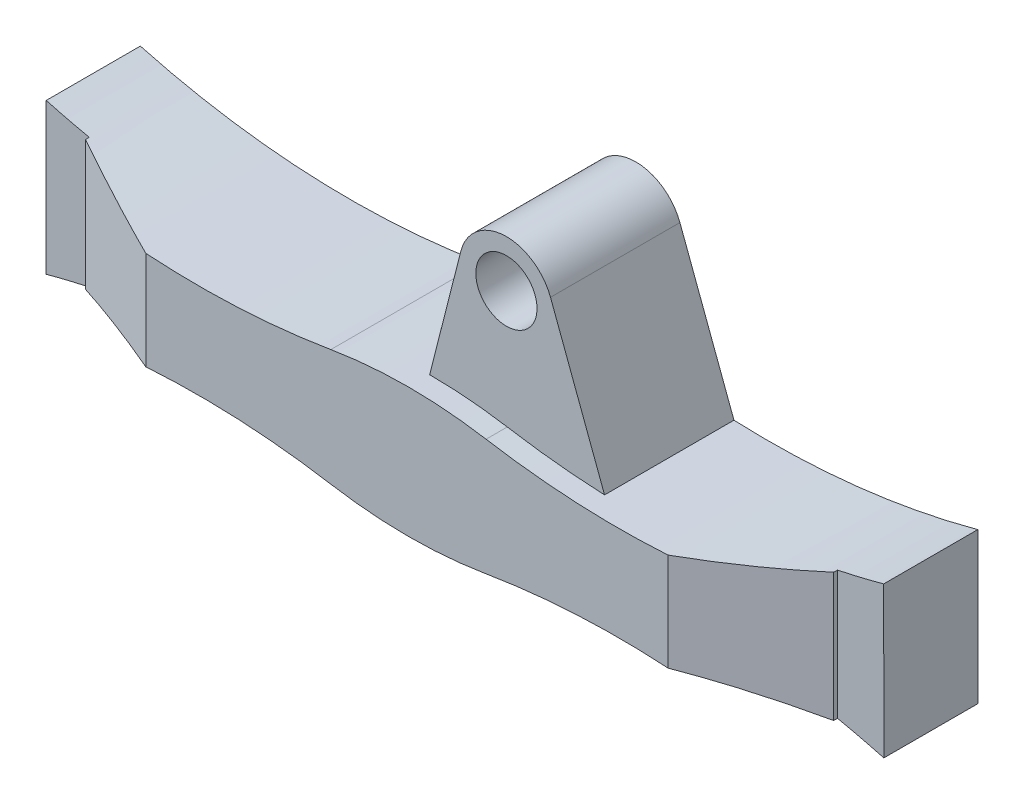
ISO-10303-21;
HEADER;
FILE_DESCRIPTION(('STEP AP214'),'2;1');
FILE_NAME('part.step','',(''),(''),'','','');
FILE_SCHEMA(('AUTOMOTIVE_DESIGN { 1 0 10303 214 1 1 1 1 }'));
ENDSEC;
DATA;
#1=APPLICATION_CONTEXT('core data for automotive mechanical design processes');
#2=APPLICATION_PROTOCOL_DEFINITION('international standard','automotive_design',2000,#1);
#3=PRODUCT_CONTEXT('',#1,'mechanical');
#4=PRODUCT('Part','Part','',(#3));
#5=PRODUCT_RELATED_PRODUCT_CATEGORY('part','',(#4));
#6=PRODUCT_DEFINITION_FORMATION('','',#4);
#7=PRODUCT_DEFINITION_CONTEXT('part definition',#1,'design');
#8=PRODUCT_DEFINITION('design','',#6,#7);
#9=PRODUCT_DEFINITION_SHAPE('','',#8);
#10=(LENGTH_UNIT() NAMED_UNIT(*) SI_UNIT(.MILLI.,.METRE.));
#11=(NAMED_UNIT(*) PLANE_ANGLE_UNIT() SI_UNIT($,.RADIAN.));
#12=(NAMED_UNIT(*) SI_UNIT($,.STERADIAN.) SOLID_ANGLE_UNIT());
#13=UNCERTAINTY_MEASURE_WITH_UNIT(LENGTH_MEASURE(1.E-05),#10,'distance_accuracy_value','');
#14=(GEOMETRIC_REPRESENTATION_CONTEXT(3) GLOBAL_UNCERTAINTY_ASSIGNED_CONTEXT((#13)) GLOBAL_UNIT_ASSIGNED_CONTEXT((#10,
#11,#12)) REPRESENTATION_CONTEXT('',''));
#15=CARTESIAN_POINT('',(0.,0.,0.));
#16=DIRECTION('',(0.,0.,1.));
#17=DIRECTION('',(1.,0.,0.));
#18=AXIS2_PLACEMENT_3D('',#15,#16,#17);
#19=CARTESIAN_POINT('',(6.27431846807554,14.0509458142658,14.0514516902904));
#20=DIRECTION('',(0.,0.,1.));
#21=DIRECTION('',(1.,0.,0.));
#22=AXIS2_PLACEMENT_3D('',#19,#20,#21);
#23=PLANE('',#22);
#24=CARTESIAN_POINT('',(7.93862948280425,17.7847876623105,14.0514516902904));
#25=DIRECTION('',(0.,0.,-1.));
#26=DIRECTION('',(-1.,0.,0.));
#27=AXIS2_PLACEMENT_3D('',#24,#25,#26);
#28=CIRCLE('',#27,0.65);
#29=CARTESIAN_POINT('',(7.28862948280424,17.7847876623105,14.0514516902904));
#30=VERTEX_POINT('',#29);
#31=EDGE_CURVE('E338',#30,#30,#28,.T.);
#32=ORIENTED_EDGE('',*,*,#31,.F.);
#33=EDGE_LOOP('',(#32));
#34=FACE_BOUND('',#33,.T.);
#35=DIRECTION('',(-0.00145502542858702,-0.999998941449941,0.));
#36=VECTOR('',#35,1.);
#37=CARTESIAN_POINT('',(-2.59314168113384,14.0638482079277,14.0514516902904));
#38=LINE('',#37,#36);
#39=CARTESIAN_POINT('',(-2.5908324113145,15.6509458142658,14.0514516902904));
#40=VERTEX_POINT('',#39);
#41=CARTESIAN_POINT('',(-2.59548849761467,12.4509458142658,14.0514516902904));
#42=VERTEX_POINT('',#41);
#43=EDGE_CURVE('E179',#40,#42,#38,.T.);
#44=ORIENTED_EDGE('',*,*,#43,.F.);
#45=CARTESIAN_POINT('',(1.85800012354398,32.0299671285904,14.0514516902904));
#46=DIRECTION('',(0.,0.,-1.));
#47=DIRECTION('',(-1.,0.,0.));
#48=AXIS2_PLACEMENT_3D('',#45,#46,#47);
#49=CIRCLE('',#48,16.9724615226641);
#50=CARTESIAN_POINT('',(4.65743461176132,15.2899666302483,14.0514516902904));
#51=VERTEX_POINT('',#50);
#52=EDGE_CURVE('E192',#40,#51,#49,.F.);
#53=ORIENTED_EDGE('',*,*,#52,.T.);
#54=CARTESIAN_POINT('',(6.30683265840241,5.42693027810318,14.0514516902904));
#55=DIRECTION('',(0.,0.,1.));
#56=DIRECTION('',(1.,0.,0.));
#57=AXIS2_PLACEMENT_3D('',#54,#55,#56);
#58=CIRCLE('',#57,10.);
#59=CARTESIAN_POINT('',(6.30683265840242,15.4269302781032,14.0514516902904));
#60=VERTEX_POINT('',#59);
#61=EDGE_CURVE('E292',#51,#60,#58,.F.);
#62=ORIENTED_EDGE('',*,*,#61,.T.);
#63=DIRECTION('',(0.246583767028973,0.969121481465457,0.));
#64=VECTOR('',#63,1.);
#65=CARTESIAN_POINT('',(2.23678706441933,-0.569129248432469,14.0514516902904));
#66=LINE('',#65,#64);
#67=CARTESIAN_POINT('',(6.96950800133879,18.0313714293395,14.0514516902904));
#68=VERTEX_POINT('',#67);
#69=EDGE_CURVE('E335',#60,#68,#66,.T.);
#70=ORIENTED_EDGE('',*,*,#69,.T.);
#71=CARTESIAN_POINT('',(7.93862948280425,17.7847876623105,14.0514516902904));
#72=DIRECTION('',(0.,0.,-1.));
#73=DIRECTION('',(-1.,0.,0.));
#74=AXIS2_PLACEMENT_3D('',#71,#72,#73);
#75=CIRCLE('',#74,0.999999999999999);
#76=CARTESIAN_POINT('',(8.87494823103114,18.1359389142217,14.0514516902904));
#77=VERTEX_POINT('',#76);
#78=EDGE_CURVE('E332',#68,#77,#75,.T.);
#79=ORIENTED_EDGE('',*,*,#78,.T.);
#80=DIRECTION('',(-0.351151251911223,0.936318748226896,0.));
#81=VECTOR('',#80,1.);
#82=CARTESIAN_POINT('',(13.743509498287,5.15428167503463,14.0514516902904));
#83=LINE('',#82,#81);
#84=CARTESIAN_POINT('',(10.0235402901545,15.0733034454077,14.0514516902904));
#85=VERTEX_POINT('',#84);
#86=EDGE_CURVE('E328',#85,#77,#83,.T.);
#87=ORIENTED_EDGE('',*,*,#86,.F.);
#88=CARTESIAN_POINT('',(10.7556651932609,32.0299671285904,14.0514516902904));
#89=DIRECTION('',(0.,0.,-1.));
#90=DIRECTION('',(-1.,0.,0.));
#91=AXIS2_PLACEMENT_3D('',#88,#89,#90);
#92=CIRCLE('',#91,16.9724615226641);
#93=CARTESIAN_POINT('',(15.2044977281194,15.6509458142658,14.0514516902904));
#94=VERTEX_POINT('',#93);
#95=EDGE_CURVE('E227',#94,#85,#92,.T.);
#96=ORIENTED_EDGE('',*,*,#95,.F.);
#97=DIRECTION('',(-0.00145502542859009,0.999998941449941,0.));
#98=VECTOR('',#97,1.);
#99=CARTESIAN_POINT('',(15.2068068602672,14.063942825775,14.0514516902904));
#100=LINE('',#99,#98);
#101=CARTESIAN_POINT('',(15.2091538144195,12.4509458142658,14.0514516902904));
#102=VERTEX_POINT('',#101);
#103=EDGE_CURVE('E197',#102,#94,#100,.T.);
#104=ORIENTED_EDGE('',*,*,#103,.F.);
#105=DIRECTION('',(1.,0.,0.));
#106=VECTOR('',#105,1.);
#107=CARTESIAN_POINT('',(-2.59548849761469,12.4509458142658,14.0514516902904));
#108=LINE('',#107,#106);
#109=CARTESIAN_POINT('',(15.2044977281192,12.4509458142658,14.0514516902904));
#110=VERTEX_POINT('',#109);
#111=EDGE_CURVE('E272',#110,#102,#108,.T.);
#112=ORIENTED_EDGE('',*,*,#111,.F.);
#113=CARTESIAN_POINT('',(10.7556651932608,-3.92807550005881,14.0514516902904));
#114=DIRECTION('',(0.,0.,-1.));
#115=DIRECTION('',(-1.,0.,0.));
#116=AXIS2_PLACEMENT_3D('',#113,#114,#115);
#117=CIRCLE('',#116,16.9724615226641);
#118=CARTESIAN_POINT('',(7.95623070504352,12.8119249982833,14.0514516902904));
#119=VERTEX_POINT('',#118);
#120=EDGE_CURVE('E228',#110,#119,#117,.F.);
#121=ORIENTED_EDGE('',*,*,#120,.T.);
#122=CARTESIAN_POINT('',(6.30683265840243,22.6749613504285,14.0514516902904));
#123=DIRECTION('',(0.,0.,1.));
#124=DIRECTION('',(1.,0.,0.));
#125=AXIS2_PLACEMENT_3D('',#122,#123,#124);
#126=CIRCLE('',#125,10.);
#127=CARTESIAN_POINT('',(4.65743461176133,12.8119249982833,14.0514516902904));
#128=VERTEX_POINT('',#127);
#129=EDGE_CURVE('E294',#119,#128,#126,.F.);
#130=ORIENTED_EDGE('',*,*,#129,.T.);
#131=CARTESIAN_POINT('',(1.85800012354398,-3.9280755000588,14.0514516902904));
#132=DIRECTION('',(0.,0.,-1.));
#133=DIRECTION('',(-1.,0.,0.));
#134=AXIS2_PLACEMENT_3D('',#131,#132,#133);
#135=CIRCLE('',#134,16.9724615226641);
#136=CARTESIAN_POINT('',(-2.59083241131446,12.4509458142658,14.0514516902904));
#137=VERTEX_POINT('',#136);
#138=EDGE_CURVE('E205',#137,#128,#135,.T.);
#139=ORIENTED_EDGE('',*,*,#138,.F.);
#140=EDGE_CURVE('E195',#42,#137,#108,.T.);
#141=ORIENTED_EDGE('',*,*,#140,.F.);
#142=EDGE_LOOP('',(#44,#53,#62,#70,#79,#87,#96,#104,#112,#121,#130,#139,#141));
#143=FACE_BOUND('',#142,.T.);
#144=ADVANCED_FACE('F41',(#34,#143),#23,.F.);
#145=CARTESIAN_POINT('',(10.7556651932609,32.0299671285904,17.2514517826776));
#146=DIRECTION('',(0.,0.,-1.));
#147=DIRECTION('',(-1.,0.,0.));
#148=AXIS2_PLACEMENT_3D('',#145,#146,#147);
#149=CYLINDRICAL_SURFACE('',#148,16.9724615226641);
#150=DIRECTION('',(0.,0.,-1.));
#151=VECTOR('',#150,1.);
#152=CARTESIAN_POINT('',(10.0235402901545,15.0733034454077,16.8014516902904));
#153=LINE('',#152,#151);
#154=CARTESIAN_POINT('',(10.0235402901545,15.0733034454077,16.8014516902904));
#155=VERTEX_POINT('',#154);
#156=EDGE_CURVE('E208',#155,#85,#153,.T.);
#157=ORIENTED_EDGE('',*,*,#156,.F.);
#158=CARTESIAN_POINT('',(10.7556651932609,32.0299671285904,16.8014516902904));
#159=DIRECTION('',(0.,0.,-1.));
#160=DIRECTION('',(-1.,0.,0.));
#161=AXIS2_PLACEMENT_3D('',#158,#159,#160);
#162=CIRCLE('',#161,16.9724615226641);
#163=CARTESIAN_POINT('',(7.95623070504353,15.2899666302483,16.8014516902904));
#164=VERTEX_POINT('',#163);
#165=EDGE_CURVE('E342',#164,#155,#162,.F.);
#166=ORIENTED_EDGE('',*,*,#165,.F.);
#167=DIRECTION('',(0.,0.,-1.));
#168=VECTOR('',#167,1.);
#169=CARTESIAN_POINT('',(7.95623070504353,15.2899666302483,17.2514517826776));
#170=LINE('',#169,#168);
#171=CARTESIAN_POINT('',(7.95623070504353,15.2899666302483,17.2514517826776));
#172=VERTEX_POINT('',#171);
#173=EDGE_CURVE('E11',#164,#172,#170,.F.);
#174=ORIENTED_EDGE('',*,*,#173,.T.);
#175=CARTESIAN_POINT('',(10.7556651932609,32.0299671285904,17.2514517826776));
#176=DIRECTION('',(0.,0.,1.));
#177=DIRECTION('',(1.,0.,0.));
#178=AXIS2_PLACEMENT_3D('',#175,#176,#177);
#179=CIRCLE('',#178,16.9724615226641);
#180=CARTESIAN_POINT('',(11.8237292918082,15.0911451736932,17.2514517826776));
#181=VERTEX_POINT('',#180);
#182=EDGE_CURVE('E186',#172,#181,#179,.T.);
#183=ORIENTED_EDGE('',*,*,#182,.T.);
#184=CARTESIAN_POINT('',(10.7556651932609,32.0299671285904,17.7494979436714));
#185=DIRECTION('',(0.422618047373337,0.,0.906307886997762));
#186=DIRECTION('',(0.906307886997762,0.,-0.422618047373337));
#187=AXIS2_PLACEMENT_3D('',#184,#185,#186);
#188=ELLIPSE('',#187,18.7270372090517,16.9724615226641);
#189=CARTESIAN_POINT('',(14.223729405802,15.4156064500688,16.1323140410523));
#190=VERTEX_POINT('',#189);
#191=EDGE_CURVE('E234',#181,#190,#188,.T.);
#192=ORIENTED_EDGE('',*,*,#191,.T.);
#193=DIRECTION('',(0.,0.,-1.));
#194=VECTOR('',#193,1.);
#195=CARTESIAN_POINT('',(14.223729405802,15.4156064500688,17.2514517826776));
#196=LINE('',#195,#194);
#197=CARTESIAN_POINT('',(14.223729405802,15.4156064500688,16.0514519585113));
#198=VERTEX_POINT('',#197);
#199=EDGE_CURVE('E238',#190,#198,#196,.T.);
#200=ORIENTED_EDGE('',*,*,#199,.T.);
#201=CARTESIAN_POINT('',(10.7556651932609,32.0299671285904,16.0514516902904));
#202=DIRECTION('',(0.,0.,1.));
#203=DIRECTION('',(1.,0.,0.));
#204=AXIS2_PLACEMENT_3D('',#201,#202,#203);
#205=CIRCLE('',#204,16.9724615226641);
#206=CARTESIAN_POINT('',(15.2044977281194,15.6509458142658,16.0514516902904));
#207=VERTEX_POINT('',#206);
#208=EDGE_CURVE('E240',#198,#207,#205,.T.);
#209=ORIENTED_EDGE('',*,*,#208,.T.);
#210=DIRECTION('',(0.,0.,1.));
#211=VECTOR('',#210,1.);
#212=CARTESIAN_POINT('',(15.2044977281194,15.6509458142658,14.0514516902904));
#213=LINE('',#212,#211);
#214=EDGE_CURVE('E187',#94,#207,#213,.T.);
#215=ORIENTED_EDGE('',*,*,#214,.F.);
#216=ORIENTED_EDGE('',*,*,#95,.T.);
#217=EDGE_LOOP('',(#157,#166,#174,#183,#192,#200,#209,#215,#216));
#218=FACE_BOUND('',#217,.T.);
#219=ADVANCED_FACE('F362',(#218),#149,.F.);
#220=CARTESIAN_POINT('',(11.8237292918082,31.5949897368528,17.2514517826776));
#221=DIRECTION('',(0.,0.,1.));
#222=DIRECTION('',(1.,0.,0.));
#223=AXIS2_PLACEMENT_3D('',#220,#221,#222);
#224=PLANE('',#223);
#225=CARTESIAN_POINT('',(1.85800012354398,-3.9280755000588,17.2514517826776));
#226=DIRECTION('',(0.,0.,-1.));
#227=DIRECTION('',(-1.,0.,0.));
#228=AXIS2_PLACEMENT_3D('',#225,#226,#227);
#229=CIRCLE('',#228,16.9724615226641);
#230=CARTESIAN_POINT('',(0.724907644342921,13.0065207919079,17.2514517826776));
#231=VERTEX_POINT('',#230);
#232=CARTESIAN_POINT('',(4.65743461176133,12.8119249982833,17.2514517826776));
#233=VERTEX_POINT('',#232);
#234=EDGE_CURVE('E306',#231,#233,#229,.T.);
#235=ORIENTED_EDGE('',*,*,#234,.T.);
#236=CARTESIAN_POINT('',(6.30683265840243,22.6749613504285,17.2514517826776));
#237=DIRECTION('',(0.,0.,1.));
#238=DIRECTION('',(1.,0.,0.));
#239=AXIS2_PLACEMENT_3D('',#236,#237,#238);
#240=CIRCLE('',#239,10.);
#241=CARTESIAN_POINT('',(7.95623070504352,12.8119249982833,17.2514517826776));
#242=VERTEX_POINT('',#241);
#243=EDGE_CURVE('E299',#233,#242,#240,.T.);
#244=ORIENTED_EDGE('',*,*,#243,.T.);
#245=CARTESIAN_POINT('',(10.7556651932608,-3.92807550005881,17.2514517826776));
#246=DIRECTION('',(0.,0.,1.));
#247=DIRECTION('',(1.,0.,0.));
#248=AXIS2_PLACEMENT_3D('',#245,#246,#247);
#249=CIRCLE('',#248,16.9724615226641);
#250=CARTESIAN_POINT('',(11.8237292918082,13.0107464548384,17.2514517826776));
#251=VERTEX_POINT('',#250);
#252=EDGE_CURVE('E287',#242,#251,#249,.F.);
#253=ORIENTED_EDGE('',*,*,#252,.T.);
#254=DIRECTION('',(0.,-1.,0.));
#255=VECTOR('',#254,1.);
#256=CARTESIAN_POINT('',(11.8237292918082,31.5949897368528,17.2514517826776));
#257=LINE('',#256,#255);
#258=EDGE_CURVE('E260',#181,#251,#257,.T.);
#259=ORIENTED_EDGE('',*,*,#258,.F.);
#260=ORIENTED_EDGE('',*,*,#182,.F.);
#261=CARTESIAN_POINT('',(6.30683265840241,5.42693027810318,17.2514517826776));
#262=DIRECTION('',(0.,0.,1.));
#263=DIRECTION('',(1.,0.,0.));
#264=AXIS2_PLACEMENT_3D('',#261,#262,#263);
#265=CIRCLE('',#264,10.);
#266=CARTESIAN_POINT('',(4.65743461176132,15.2899666302483,17.2514517826776));
#267=VERTEX_POINT('',#266);
#268=EDGE_CURVE('E55',#172,#267,#265,.T.);
#269=ORIENTED_EDGE('',*,*,#268,.T.);
#270=CARTESIAN_POINT('',(1.85800012354398,32.0299671285904,17.2514517826776));
#271=DIRECTION('',(0.,0.,-1.));
#272=DIRECTION('',(-1.,0.,0.));
#273=AXIS2_PLACEMENT_3D('',#270,#271,#272);
#274=CIRCLE('',#273,16.9724615226641);
#275=CARTESIAN_POINT('',(0.724907644342921,15.0953708366237,17.2514517826776));
#276=VERTEX_POINT('',#275);
#277=EDGE_CURVE('E202',#276,#267,#274,.F.);
#278=ORIENTED_EDGE('',*,*,#277,.F.);
#279=DIRECTION('',(0.,-1.,0.));
#280=VECTOR('',#279,1.);
#281=CARTESIAN_POINT('',(0.724907644342921,31.5949897368528,17.2514517826776));
#282=LINE('',#281,#280);
#283=EDGE_CURVE('E257',#276,#231,#282,.T.);
#284=ORIENTED_EDGE('',*,*,#283,.T.);
#285=EDGE_LOOP('',(#235,#244,#253,#259,#260,#269,#278,#284));
#286=FACE_BOUND('',#285,.T.);
#287=ADVANCED_FACE('F303',(#286),#224,.T.);
#288=CARTESIAN_POINT('',(6.27431846807554,14.0509458142658,16.0514516902904));
#289=DIRECTION('',(0.,0.,1.));
#290=DIRECTION('',(1.,0.,0.));
#291=AXIS2_PLACEMENT_3D('',#288,#289,#290);
#292=PLANE('',#291);
#293=CARTESIAN_POINT('',(1.85800012354398,-3.9280755000588,16.0514516902904));
#294=DIRECTION('',(0.,0.,1.));
#295=DIRECTION('',(1.,0.,0.));
#296=AXIS2_PLACEMENT_3D('',#293,#294,#295);
#297=CIRCLE('',#296,16.9724615226641);
#298=CARTESIAN_POINT('',(-1.67509246965096,12.6725783083376,16.0514519585113));
#299=VERTEX_POINT('',#298);
#300=CARTESIAN_POINT('',(-2.59083241131446,12.4509458142658,16.0514516902904));
#301=VERTEX_POINT('',#300);
#302=EDGE_CURVE('E217',#299,#301,#297,.T.);
#303=ORIENTED_EDGE('',*,*,#302,.F.);
#304=DIRECTION('',(0.,-1.,0.));
#305=VECTOR('',#304,1.);
#306=CARTESIAN_POINT('',(-1.67509246965096,31.5949897368528,16.0514519585113));
#307=LINE('',#306,#305);
#308=CARTESIAN_POINT('',(-1.67509246965096,15.429313320194,16.0514519585113));
#309=VERTEX_POINT('',#308);
#310=EDGE_CURVE('E256',#309,#299,#307,.T.);
#311=ORIENTED_EDGE('',*,*,#310,.F.);
#312=CARTESIAN_POINT('',(1.85800012354398,32.0299671285904,16.0514516902904));
#313=DIRECTION('',(0.,0.,1.));
#314=DIRECTION('',(1.,0.,0.));
#315=AXIS2_PLACEMENT_3D('',#312,#313,#314);
#316=CIRCLE('',#315,16.9724615226641);
#317=CARTESIAN_POINT('',(-2.5908324113145,15.6509458142658,16.0514516902904));
#318=VERTEX_POINT('',#317);
#319=EDGE_CURVE('E225',#309,#318,#316,.F.);
#320=ORIENTED_EDGE('',*,*,#319,.T.);
#321=DIRECTION('',(-0.00145502542859039,-0.999998941449941,0.));
#322=VECTOR('',#321,1.);
#323=CARTESIAN_POINT('',(-2.5908324113145,15.6509458142658,16.0514516902904));
#324=LINE('',#323,#322);
#325=CARTESIAN_POINT('',(-2.59548849761467,12.4509458142658,16.0514516902904));
#326=VERTEX_POINT('',#325);
#327=EDGE_CURVE('E182',#318,#326,#324,.T.);
#328=ORIENTED_EDGE('',*,*,#327,.T.);
#329=DIRECTION('',(1.,0.,0.));
#330=VECTOR('',#329,1.);
#331=CARTESIAN_POINT('',(14.5424408064123,12.4509458142658,16.0514516902904));
#332=LINE('',#331,#330);
#333=EDGE_CURVE('E275',#326,#301,#332,.T.);
#334=ORIENTED_EDGE('',*,*,#333,.T.);
#335=EDGE_LOOP('',(#303,#311,#320,#328,#334));
#336=FACE_BOUND('',#335,.T.);
#337=ADVANCED_FACE('F433',(#336),#292,.T.);
#338=CARTESIAN_POINT('',(-1.67509246965096,31.5949897368528,16.1323140410523));
#339=DIRECTION('',(-0.422618047373337,0.,0.906307886997762));
#340=DIRECTION('',(0.906307886997762,0.,0.422618047373337));
#341=AXIS2_PLACEMENT_3D('',#338,#339,#340);
#342=PLANE('',#341);
#343=CARTESIAN_POINT('',(1.85800012354398,-3.9280755000588,17.7798211568421));
#344=DIRECTION('',(-0.422618047373337,0.,0.906307886997762));
#345=DIRECTION('',(-0.906307886997762,0.,-0.422618047373337));
#346=AXIS2_PLACEMENT_3D('',#343,#344,#345);
#347=ELLIPSE('',#346,18.7270372090517,16.9724615226641);
#348=CARTESIAN_POINT('',(-1.67509246965096,12.6725783083376,16.1323140410523));
#349=VERTEX_POINT('',#348);
#350=EDGE_CURVE('E214',#231,#349,#347,.T.);
#351=ORIENTED_EDGE('',*,*,#350,.F.);
#352=ORIENTED_EDGE('',*,*,#283,.F.);
#353=CARTESIAN_POINT('',(1.85800012354398,32.0299671285904,17.7798211568421));
#354=DIRECTION('',(-0.422618047373337,0.,0.906307886997762));
#355=DIRECTION('',(-0.906307886997762,0.,-0.422618047373337));
#356=AXIS2_PLACEMENT_3D('',#353,#354,#355);
#357=ELLIPSE('',#356,18.7270372090517,16.9724615226641);
#358=CARTESIAN_POINT('',(-1.67509246965096,15.429313320194,16.1323140410523));
#359=VERTEX_POINT('',#358);
#360=EDGE_CURVE('E222',#276,#359,#357,.F.);
#361=ORIENTED_EDGE('',*,*,#360,.T.);
#362=DIRECTION('',(0.,-1.,0.));
#363=VECTOR('',#362,1.);
#364=CARTESIAN_POINT('',(-1.67509246965096,31.5949897368528,16.1323140410523));
#365=LINE('',#364,#363);
#366=EDGE_CURVE('E253',#359,#349,#365,.T.);
#367=ORIENTED_EDGE('',*,*,#366,.T.);
#368=EDGE_LOOP('',(#351,#352,#361,#367));
#369=FACE_BOUND('',#368,.T.);
#370=ADVANCED_FACE('F429',(#369),#342,.T.);
#371=CARTESIAN_POINT('',(-1.67509246965096,31.5949897368528,16.1323140410523));
#372=DIRECTION('',(-1.,0.,0.));
#373=DIRECTION('',(0.,0.,1.));
#374=AXIS2_PLACEMENT_3D('',#371,#372,#373);
#375=PLANE('',#374);
#376=DIRECTION('',(0.,0.,-1.));
#377=VECTOR('',#376,1.);
#378=CARTESIAN_POINT('',(-1.67509246965096,12.6725783083376,17.2514517826776));
#379=LINE('',#378,#377);
#380=EDGE_CURVE('E212',#349,#299,#379,.T.);
#381=ORIENTED_EDGE('',*,*,#380,.F.);
#382=ORIENTED_EDGE('',*,*,#366,.F.);
#383=DIRECTION('',(0.,0.,-1.));
#384=VECTOR('',#383,1.);
#385=CARTESIAN_POINT('',(-1.67509246965096,15.429313320194,17.2514517826776));
#386=LINE('',#385,#384);
#387=EDGE_CURVE('E219',#359,#309,#386,.T.);
#388=ORIENTED_EDGE('',*,*,#387,.T.);
#389=ORIENTED_EDGE('',*,*,#310,.T.);
#390=EDGE_LOOP('',(#381,#382,#388,#389));
#391=FACE_BOUND('',#390,.T.);
#392=ADVANCED_FACE('F426',(#391),#375,.T.);
#393=DIRECTION('',(0.,-1.,0.));
#394=VECTOR('',#393,1.);
#395=CARTESIAN_POINT('',(14.223729405802,31.5949897368528,16.0514519585113));
#396=LINE('',#395,#394);
#397=CARTESIAN_POINT('',(14.223729405802,12.6862851784628,16.0514519585113));
#398=VERTEX_POINT('',#397);
#399=EDGE_CURVE('E252',#198,#398,#396,.T.);
#400=ORIENTED_EDGE('',*,*,#399,.T.);
#401=CARTESIAN_POINT('',(10.7556651932608,-3.92807550005881,16.0514516902904));
#402=DIRECTION('',(0.,0.,1.));
#403=DIRECTION('',(1.,0.,0.));
#404=AXIS2_PLACEMENT_3D('',#401,#402,#403);
#405=CIRCLE('',#404,16.9724615226641);
#406=CARTESIAN_POINT('',(15.2044977281192,12.4509458142658,16.0514516902904));
#407=VERTEX_POINT('',#406);
#408=EDGE_CURVE('E249',#398,#407,#405,.F.);
#409=ORIENTED_EDGE('',*,*,#408,.T.);
#410=CARTESIAN_POINT('',(15.2091538144195,12.4509458142658,16.0514516902904));
#411=VERTEX_POINT('',#410);
#412=EDGE_CURVE('E274',#407,#411,#332,.T.);
#413=ORIENTED_EDGE('',*,*,#412,.T.);
#414=DIRECTION('',(-0.00145502542859039,0.999998941449941,0.));
#415=VECTOR('',#414,1.);
#416=CARTESIAN_POINT('',(15.2044977281194,15.6509458142658,16.0514516902904));
#417=LINE('',#416,#415);
#418=EDGE_CURVE('E278',#411,#207,#417,.T.);
#419=ORIENTED_EDGE('',*,*,#418,.T.);
#420=ORIENTED_EDGE('',*,*,#208,.F.);
#421=EDGE_LOOP('',(#400,#409,#413,#419,#420));
#422=FACE_BOUND('',#421,.T.);
#423=ADVANCED_FACE('F368',(#422),#292,.T.);
#424=CARTESIAN_POINT('',(14.5424408064123,12.4509458142658,14.0514516902904));
#425=DIRECTION('',(0.,-1.,0.));
#426=DIRECTION('',(1.,0.,0.));
#427=AXIS2_PLACEMENT_3D('',#424,#425,#426);
#428=PLANE('',#427);
#429=DIRECTION('',(0.,0.,-1.));
#430=VECTOR('',#429,1.);
#431=CARTESIAN_POINT('',(-2.59083241131446,12.4509458142658,17.2514517826776));
#432=LINE('',#431,#430);
#433=EDGE_CURVE('E215',#301,#137,#432,.T.);
#434=ORIENTED_EDGE('',*,*,#433,.F.);
#435=ORIENTED_EDGE('',*,*,#333,.F.);
#436=DIRECTION('',(0.,0.,1.));
#437=VECTOR('',#436,1.);
#438=CARTESIAN_POINT('',(-2.59548849761469,12.4509458142658,14.0514516902904));
#439=LINE('',#438,#437);
#440=EDGE_CURVE('E271',#42,#326,#439,.T.);
#441=ORIENTED_EDGE('',*,*,#440,.F.);
#442=ORIENTED_EDGE('',*,*,#140,.T.);
#443=EDGE_LOOP('',(#434,#435,#441,#442));
#444=FACE_BOUND('',#443,.T.);
#445=ADVANCED_FACE('F444',(#444),#428,.T.);
#446=ORIENTED_EDGE('',*,*,#412,.F.);
#447=DIRECTION('',(0.,0.,-1.));
#448=VECTOR('',#447,1.);
#449=CARTESIAN_POINT('',(15.2044977281192,12.4509458142658,17.2514517826776));
#450=LINE('',#449,#448);
#451=EDGE_CURVE('E231',#407,#110,#450,.T.);
#452=ORIENTED_EDGE('',*,*,#451,.T.);
#453=ORIENTED_EDGE('',*,*,#111,.T.);
#454=DIRECTION('',(0.,0.,1.));
#455=VECTOR('',#454,1.);
#456=CARTESIAN_POINT('',(15.2091538144195,12.4509458142658,14.0514516902904));
#457=LINE('',#456,#455);
#458=EDGE_CURVE('E282',#102,#411,#457,.T.);
#459=ORIENTED_EDGE('',*,*,#458,.T.);
#460=EDGE_LOOP('',(#446,#452,#453,#459));
#461=FACE_BOUND('',#460,.T.);
#462=ADVANCED_FACE('F371',(#461),#428,.T.);
#463=CARTESIAN_POINT('',(14.223729405802,31.5949897368528,16.0514519585113));
#464=DIRECTION('',(1.,0.,0.));
#465=DIRECTION('',(0.,0.,-1.));
#466=AXIS2_PLACEMENT_3D('',#463,#464,#465);
#467=PLANE('',#466);
#468=DIRECTION('',(0.,-1.,0.));
#469=VECTOR('',#468,1.);
#470=CARTESIAN_POINT('',(14.223729405802,31.5949897368528,16.1323140410523));
#471=LINE('',#470,#469);
#472=CARTESIAN_POINT('',(14.223729405802,12.6862851784628,16.1323140410523));
#473=VERTEX_POINT('',#472);
#474=EDGE_CURVE('E263',#190,#473,#471,.T.);
#475=ORIENTED_EDGE('',*,*,#474,.T.);
#476=DIRECTION('',(0.,0.,-1.));
#477=VECTOR('',#476,1.);
#478=CARTESIAN_POINT('',(14.223729405802,12.6862851784628,17.2514517826776));
#479=LINE('',#478,#477);
#480=EDGE_CURVE('E246',#473,#398,#479,.T.);
#481=ORIENTED_EDGE('',*,*,#480,.T.);
#482=ORIENTED_EDGE('',*,*,#399,.F.);
#483=ORIENTED_EDGE('',*,*,#199,.F.);
#484=EDGE_LOOP('',(#475,#481,#482,#483));
#485=FACE_BOUND('',#484,.T.);
#486=ADVANCED_FACE('F373',(#485),#467,.T.);
#487=CARTESIAN_POINT('',(14.223729405802,31.5949897368528,16.1323140410523));
#488=DIRECTION('',(0.422618047373337,0.,0.906307886997762));
#489=DIRECTION('',(0.906307886997762,0.,-0.422618047373337));
#490=AXIS2_PLACEMENT_3D('',#487,#488,#489);
#491=PLANE('',#490);
#492=ORIENTED_EDGE('',*,*,#258,.T.);
#493=CARTESIAN_POINT('',(10.7556651932608,-3.92807550005881,17.7494979436714));
#494=DIRECTION('',(0.422618047373337,0.,0.906307886997762));
#495=DIRECTION('',(0.906307886997762,0.,-0.422618047373337));
#496=AXIS2_PLACEMENT_3D('',#493,#494,#495);
#497=ELLIPSE('',#496,18.7270372090517,16.9724615226641);
#498=EDGE_CURVE('E243',#251,#473,#497,.F.);
#499=ORIENTED_EDGE('',*,*,#498,.T.);
#500=ORIENTED_EDGE('',*,*,#474,.F.);
#501=ORIENTED_EDGE('',*,*,#191,.F.);
#502=EDGE_LOOP('',(#492,#499,#500,#501));
#503=FACE_BOUND('',#502,.T.);
#504=ADVANCED_FACE('F377',(#503),#491,.T.);
#505=CARTESIAN_POINT('',(10.7556651932608,-3.92807550005881,17.2514517826776));
#506=DIRECTION('',(0.,0.,-1.));
#507=DIRECTION('',(-1.,0.,0.));
#508=AXIS2_PLACEMENT_3D('',#505,#506,#507);
#509=CYLINDRICAL_SURFACE('',#508,16.9724615226641);
#510=ORIENTED_EDGE('',*,*,#252,.F.);
#511=DIRECTION('',(0.,0.,-1.));
#512=VECTOR('',#511,1.);
#513=CARTESIAN_POINT('',(7.95623070504352,12.8119249982833,17.2514517826776));
#514=LINE('',#513,#512);
#515=EDGE_CURVE('E289',#242,#119,#514,.T.);
#516=ORIENTED_EDGE('',*,*,#515,.T.);
#517=ORIENTED_EDGE('',*,*,#120,.F.);
#518=ORIENTED_EDGE('',*,*,#451,.F.);
#519=ORIENTED_EDGE('',*,*,#408,.F.);
#520=ORIENTED_EDGE('',*,*,#480,.F.);
#521=ORIENTED_EDGE('',*,*,#498,.F.);
#522=EDGE_LOOP('',(#510,#516,#517,#518,#519,#520,#521));
#523=FACE_BOUND('',#522,.T.);
#524=ADVANCED_FACE('F311',(#523),#509,.F.);
#525=CARTESIAN_POINT('',(1.85800012354398,-3.9280755000588,17.2514517826776));
#526=DIRECTION('',(0.,0.,-1.));
#527=DIRECTION('',(-1.,0.,0.));
#528=AXIS2_PLACEMENT_3D('',#525,#526,#527);
#529=CYLINDRICAL_SURFACE('',#528,16.9724615226641);
#530=ORIENTED_EDGE('',*,*,#138,.T.);
#531=DIRECTION('',(0.,0.,-1.));
#532=VECTOR('',#531,1.);
#533=CARTESIAN_POINT('',(4.65743461176133,12.8119249982833,17.2514517826776));
#534=LINE('',#533,#532);
#535=EDGE_CURVE('E296',#128,#233,#534,.F.);
#536=ORIENTED_EDGE('',*,*,#535,.T.);
#537=ORIENTED_EDGE('',*,*,#234,.F.);
#538=ORIENTED_EDGE('',*,*,#350,.T.);
#539=ORIENTED_EDGE('',*,*,#380,.T.);
#540=ORIENTED_EDGE('',*,*,#302,.T.);
#541=ORIENTED_EDGE('',*,*,#433,.T.);
#542=EDGE_LOOP('',(#530,#536,#537,#538,#539,#540,#541));
#543=FACE_BOUND('',#542,.T.);
#544=ADVANCED_FACE('F316',(#543),#529,.F.);
#545=CARTESIAN_POINT('',(1.85800012354398,32.0299671285904,17.2514517826776));
#546=DIRECTION('',(0.,0.,-1.));
#547=DIRECTION('',(-1.,0.,0.));
#548=AXIS2_PLACEMENT_3D('',#545,#546,#547);
#549=CYLINDRICAL_SURFACE('',#548,16.9724615226641);
#550=ORIENTED_EDGE('',*,*,#277,.T.);
#551=DIRECTION('',(0.,0.,-1.));
#552=VECTOR('',#551,1.);
#553=CARTESIAN_POINT('',(4.65743461176132,15.2899666302483,17.2514517826776));
#554=LINE('',#553,#552);
#555=EDGE_CURVE('E48',#267,#51,#554,.T.);
#556=ORIENTED_EDGE('',*,*,#555,.T.);
#557=ORIENTED_EDGE('',*,*,#52,.F.);
#558=DIRECTION('',(0.,0.,1.));
#559=VECTOR('',#558,1.);
#560=CARTESIAN_POINT('',(-2.5908324113145,15.6509458142658,14.0514516902904));
#561=LINE('',#560,#559);
#562=EDGE_CURVE('E176',#40,#318,#561,.T.);
#563=ORIENTED_EDGE('',*,*,#562,.T.);
#564=ORIENTED_EDGE('',*,*,#319,.F.);
#565=ORIENTED_EDGE('',*,*,#387,.F.);
#566=ORIENTED_EDGE('',*,*,#360,.F.);
#567=EDGE_LOOP('',(#550,#556,#557,#563,#564,#565,#566));
#568=FACE_BOUND('',#567,.T.);
#569=ADVANCED_FACE('F200',(#568),#549,.F.);
#570=CARTESIAN_POINT('',(6.30683265840243,22.6749613504285,17.2514517826776));
#571=DIRECTION('',(0.,0.,-1.));
#572=DIRECTION('',(-1.,0.,0.));
#573=AXIS2_PLACEMENT_3D('',#570,#571,#572);
#574=CYLINDRICAL_SURFACE('',#573,10.);
#575=ORIENTED_EDGE('',*,*,#243,.F.);
#576=ORIENTED_EDGE('',*,*,#535,.F.);
#577=ORIENTED_EDGE('',*,*,#129,.F.);
#578=ORIENTED_EDGE('',*,*,#515,.F.);
#579=EDGE_LOOP('',(#575,#576,#577,#578));
#580=FACE_BOUND('',#579,.T.);
#581=ADVANCED_FACE('F312',(#580),#574,.T.);
#582=CARTESIAN_POINT('',(6.30683265840241,5.42693027810318,17.2514517826776));
#583=DIRECTION('',(0.,0.,-1.));
#584=DIRECTION('',(-1.,0.,0.));
#585=AXIS2_PLACEMENT_3D('',#582,#583,#584);
#586=CYLINDRICAL_SURFACE('',#585,10.);
#587=DIRECTION('',(0.,0.,-1.));
#588=VECTOR('',#587,1.);
#589=CARTESIAN_POINT('',(6.30683265840242,15.4269302781032,16.8014516902904));
#590=LINE('',#589,#588);
#591=CARTESIAN_POINT('',(6.30683265840242,15.4269302781032,16.8014516902904));
#592=VERTEX_POINT('',#591);
#593=EDGE_CURVE('E203',#592,#60,#590,.T.);
#594=ORIENTED_EDGE('',*,*,#593,.T.);
#595=ORIENTED_EDGE('',*,*,#61,.F.);
#596=ORIENTED_EDGE('',*,*,#555,.F.);
#597=ORIENTED_EDGE('',*,*,#268,.F.);
#598=ORIENTED_EDGE('',*,*,#173,.F.);
#599=CARTESIAN_POINT('',(6.30683265840241,5.42693027810318,16.8014516902904));
#600=DIRECTION('',(0.,0.,-1.));
#601=DIRECTION('',(-1.,0.,0.));
#602=AXIS2_PLACEMENT_3D('',#599,#600,#601);
#603=CIRCLE('',#602,10.);
#604=EDGE_CURVE('E324',#592,#164,#603,.T.);
#605=ORIENTED_EDGE('',*,*,#604,.F.);
#606=EDGE_LOOP('',(#594,#595,#596,#597,#598,#605));
#607=FACE_BOUND('',#606,.T.);
#608=ADVANCED_FACE('F379',(#607),#586,.T.);
#609=CARTESIAN_POINT('',(2.23678706441933,-0.569129248432469,16.8014516902904));
#610=DIRECTION('',(-0.969121481465457,0.246583767028973,0.));
#611=DIRECTION('',(-0.246583767028973,-0.969121481465457,0.));
#612=AXIS2_PLACEMENT_3D('',#609,#610,#611);
#613=PLANE('',#612);
#614=ORIENTED_EDGE('',*,*,#69,.F.);
#615=ORIENTED_EDGE('',*,*,#593,.F.);
#616=DIRECTION('',(0.246583767028973,0.969121481465457,0.));
#617=VECTOR('',#616,1.);
#618=CARTESIAN_POINT('',(2.23678706441933,-0.569129248432469,16.8014516902904));
#619=LINE('',#618,#617);
#620=CARTESIAN_POINT('',(6.96950800133879,18.0313714293395,16.8014516902904));
#621=VERTEX_POINT('',#620);
#622=EDGE_CURVE('E350',#592,#621,#619,.T.);
#623=ORIENTED_EDGE('',*,*,#622,.T.);
#624=DIRECTION('',(0.,0.,-1.));
#625=VECTOR('',#624,1.);
#626=CARTESIAN_POINT('',(6.96950800133879,18.0313714293395,16.8014516902904));
#627=LINE('',#626,#625);
#628=EDGE_CURVE('E321',#621,#68,#627,.T.);
#629=ORIENTED_EDGE('',*,*,#628,.T.);
#630=EDGE_LOOP('',(#614,#615,#623,#629));
#631=FACE_BOUND('',#630,.T.);
#632=ADVANCED_FACE('F383',(#631),#613,.T.);
#633=CARTESIAN_POINT('',(13.743509498287,5.15428167503463,16.8014516902904));
#634=DIRECTION('',(-0.936318748226896,-0.351151251911223,0.));
#635=DIRECTION('',(0.351151251911223,-0.936318748226896,0.));
#636=AXIS2_PLACEMENT_3D('',#633,#634,#635);
#637=PLANE('',#636);
#638=ORIENTED_EDGE('',*,*,#86,.T.);
#639=DIRECTION('',(0.,0.,-1.));
#640=VECTOR('',#639,1.);
#641=CARTESIAN_POINT('',(8.87494823103114,18.1359389142217,16.8014516902904));
#642=LINE('',#641,#640);
#643=CARTESIAN_POINT('',(8.87494823103114,18.1359389142217,16.8014516902904));
#644=VERTEX_POINT('',#643);
#645=EDGE_CURVE('E323',#644,#77,#642,.T.);
#646=ORIENTED_EDGE('',*,*,#645,.F.);
#647=DIRECTION('',(-0.351151251911223,0.936318748226896,0.));
#648=VECTOR('',#647,1.);
#649=CARTESIAN_POINT('',(13.743509498287,5.15428167503463,16.8014516902904));
#650=LINE('',#649,#648);
#651=EDGE_CURVE('E345',#155,#644,#650,.T.);
#652=ORIENTED_EDGE('',*,*,#651,.F.);
#653=ORIENTED_EDGE('',*,*,#156,.T.);
#654=EDGE_LOOP('',(#638,#646,#652,#653));
#655=FACE_BOUND('',#654,.T.);
#656=ADVANCED_FACE('F390',(#655),#637,.F.);
#657=CARTESIAN_POINT('',(7.93862948280425,17.7847876623105,16.8014516902904));
#658=DIRECTION('',(0.,0.,-1.));
#659=DIRECTION('',(-1.,0.,0.));
#660=AXIS2_PLACEMENT_3D('',#657,#658,#659);
#661=CYLINDRICAL_SURFACE('',#660,0.65);
#662=CARTESIAN_POINT('',(7.93862948280425,17.7847876623105,16.8014516902904));
#663=DIRECTION('',(0.,0.,-1.));
#664=DIRECTION('',(-1.,0.,0.));
#665=AXIS2_PLACEMENT_3D('',#662,#663,#664);
#666=CIRCLE('',#665,0.65);
#667=CARTESIAN_POINT('',(7.28862948280424,17.7847876623105,16.8014516902904));
#668=VERTEX_POINT('',#667);
#669=EDGE_CURVE('E331',#668,#668,#666,.T.);
#670=ORIENTED_EDGE('',*,*,#669,.F.);
#671=EDGE_LOOP('',(#670));
#672=FACE_BOUND('',#671,.T.);
#673=ORIENTED_EDGE('',*,*,#31,.T.);
#674=EDGE_LOOP('',(#673));
#675=FACE_BOUND('',#674,.T.);
#676=ADVANCED_FACE('F401',(#672,#675),#661,.F.);
#677=CARTESIAN_POINT('',(7.93862948280425,17.7847876623105,16.8014516902904));
#678=DIRECTION('',(0.,0.,-1.));
#679=DIRECTION('',(-1.,0.,0.));
#680=AXIS2_PLACEMENT_3D('',#677,#678,#679);
#681=CYLINDRICAL_SURFACE('',#680,0.999999999999999);
#682=ORIENTED_EDGE('',*,*,#78,.F.);
#683=ORIENTED_EDGE('',*,*,#628,.F.);
#684=CARTESIAN_POINT('',(7.93862948280425,17.7847876623105,16.8014516902904));
#685=DIRECTION('',(0.,0.,-1.));
#686=DIRECTION('',(-1.,0.,0.));
#687=AXIS2_PLACEMENT_3D('',#684,#685,#686);
#688=CIRCLE('',#687,0.999999999999999);
#689=EDGE_CURVE('E347',#621,#644,#688,.T.);
#690=ORIENTED_EDGE('',*,*,#689,.T.);
#691=ORIENTED_EDGE('',*,*,#645,.T.);
#692=EDGE_LOOP('',(#682,#683,#690,#691));
#693=FACE_BOUND('',#692,.T.);
#694=ADVANCED_FACE('F387',(#693),#681,.T.);
#695=CARTESIAN_POINT('',(0.,0.,16.8014516902904));
#696=DIRECTION('',(0.,0.,-1.));
#697=DIRECTION('',(-1.,0.,0.));
#698=AXIS2_PLACEMENT_3D('',#695,#696,#697);
#699=PLANE('',#698);
#700=ORIENTED_EDGE('',*,*,#669,.T.);
#701=EDGE_LOOP('',(#700));
#702=FACE_BOUND('',#701,.T.);
#703=ORIENTED_EDGE('',*,*,#622,.F.);
#704=ORIENTED_EDGE('',*,*,#604,.T.);
#705=ORIENTED_EDGE('',*,*,#165,.T.);
#706=ORIENTED_EDGE('',*,*,#651,.T.);
#707=ORIENTED_EDGE('',*,*,#689,.F.);
#708=EDGE_LOOP('',(#703,#704,#705,#706,#707));
#709=FACE_BOUND('',#708,.T.);
#710=ADVANCED_FACE('F392',(#702,#709),#699,.F.);
#711=CARTESIAN_POINT('',(-2.58779432410766,17.7389395573129,25.8514516902904));
#712=DIRECTION('',(-0.999998941449941,0.00145502542858702,0.));
#713=DIRECTION('',(-0.00145502542858702,-0.999998941449941,0.));
#714=AXIS2_PLACEMENT_3D('',#711,#712,#713);
#715=PLANE('',#714);
#716=ORIENTED_EDGE('',*,*,#327,.F.);
#717=ORIENTED_EDGE('',*,*,#562,.F.);
#718=ORIENTED_EDGE('',*,*,#43,.T.);
#719=ORIENTED_EDGE('',*,*,#440,.T.);
#720=EDGE_LOOP('',(#716,#717,#718,#719));
#721=FACE_BOUND('',#720,.T.);
#722=ADVANCED_FACE('F178',(#721),#715,.T.);
#723=CARTESIAN_POINT('',(15.2121875456495,10.3659458142658,25.8514516902904));
#724=DIRECTION('',(0.999998941449941,0.00145502542859009,0.));
#725=DIRECTION('',(-0.00145502542859009,0.999998941449941,0.));
#726=AXIS2_PLACEMENT_3D('',#723,#724,#725);
#727=PLANE('',#726);
#728=ORIENTED_EDGE('',*,*,#214,.T.);
#729=ORIENTED_EDGE('',*,*,#418,.F.);
#730=ORIENTED_EDGE('',*,*,#458,.F.);
#731=ORIENTED_EDGE('',*,*,#103,.T.);
#732=EDGE_LOOP('',(#728,#729,#730,#731));
#733=FACE_BOUND('',#732,.T.);
#734=ADVANCED_FACE('F358',(#733),#727,.T.);
#735=CLOSED_SHELL('',(#144,#219,#287,#337,#370,#392,#423,#445,#462,#486,#504,#524,#544,#569,
#581,#608,#632,#656,#676,#694,#710,#722,#734));
#736=MANIFOLD_SOLID_BREP('B2',#735);
#737=ADVANCED_BREP_SHAPE_REPRESENTATION('',(#18,#736),#14);
#738=SHAPE_DEFINITION_REPRESENTATION(#9,#737);
ENDSEC;
END-ISO-10303-21;
